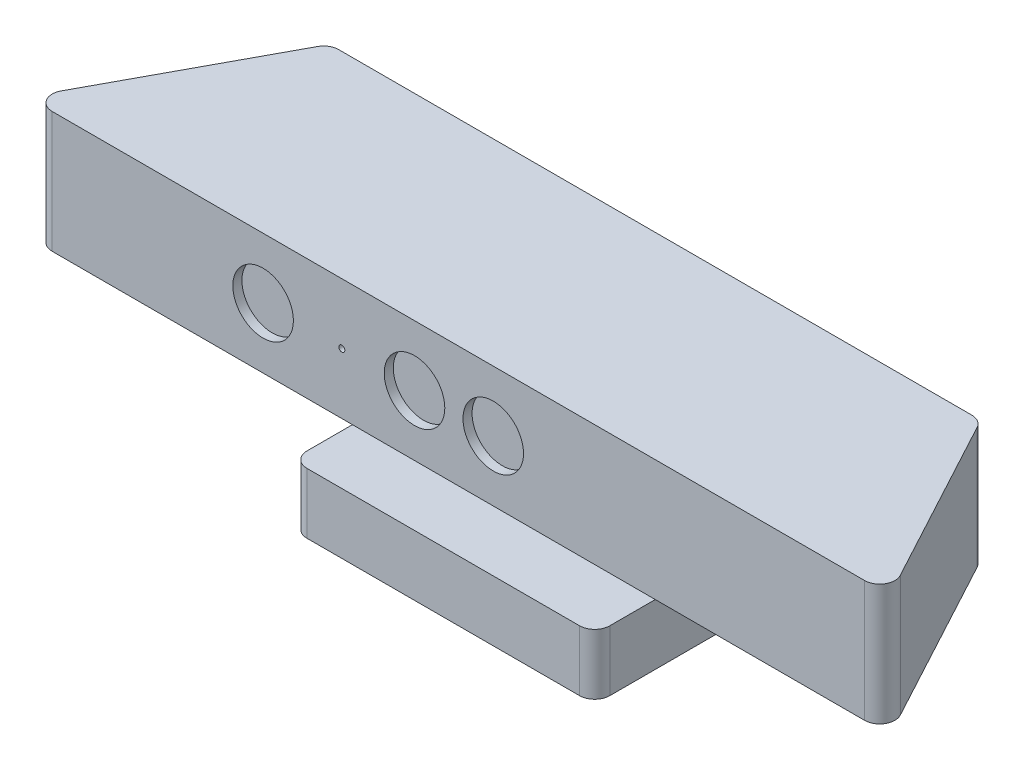
ISO-10303-21;
HEADER;
FILE_DESCRIPTION(('STEP AP214'),'2;1');
FILE_NAME('part.step','',(''),(''),'','','');
FILE_SCHEMA(('AUTOMOTIVE_DESIGN { 1 0 10303 214 1 1 1 1 }'));
ENDSEC;
DATA;
#1=APPLICATION_CONTEXT('core data for automotive mechanical design processes');
#2=APPLICATION_PROTOCOL_DEFINITION('international standard','automotive_design',2000,#1);
#3=PRODUCT_CONTEXT('',#1,'mechanical');
#4=PRODUCT('Part','Part','',(#3));
#5=PRODUCT_RELATED_PRODUCT_CATEGORY('part','',(#4));
#6=PRODUCT_DEFINITION_FORMATION('','',#4);
#7=PRODUCT_DEFINITION_CONTEXT('part definition',#1,'design');
#8=PRODUCT_DEFINITION('design','',#6,#7);
#9=PRODUCT_DEFINITION_SHAPE('','',#8);
#10=(LENGTH_UNIT() NAMED_UNIT(*) SI_UNIT(.MILLI.,.METRE.));
#11=(NAMED_UNIT(*) PLANE_ANGLE_UNIT() SI_UNIT($,.RADIAN.));
#12=(NAMED_UNIT(*) SI_UNIT($,.STERADIAN.) SOLID_ANGLE_UNIT());
#13=UNCERTAINTY_MEASURE_WITH_UNIT(LENGTH_MEASURE(1.E-05),#10,'distance_accuracy_value','');
#14=(GEOMETRIC_REPRESENTATION_CONTEXT(3) GLOBAL_UNCERTAINTY_ASSIGNED_CONTEXT((#13)) GLOBAL_UNIT_ASSIGNED_CONTEXT((#10,
#11,#12)) REPRESENTATION_CONTEXT('',''));
#15=CARTESIAN_POINT('',(0.,0.,0.));
#16=DIRECTION('',(0.,0.,1.));
#17=DIRECTION('',(1.,0.,0.));
#18=AXIS2_PLACEMENT_3D('',#15,#16,#17);
#19=CARTESIAN_POINT('',(-142.5,40.,80.7413552305434));
#20=DIRECTION('',(0.,0.,-1.));
#21=DIRECTION('',(-1.,0.,0.));
#22=AXIS2_PLACEMENT_3D('',#19,#20,#21);
#23=PLANE('',#22);
#24=CARTESIAN_POINT('',(11.5,20.,80.7413552305434));
#25=DIRECTION('',(0.,0.,1.));
#26=DIRECTION('',(1.,0.,0.));
#27=AXIS2_PLACEMENT_3D('',#24,#25,#26);
#28=CIRCLE('',#27,10.);
#29=CARTESIAN_POINT('',(21.5,20.,80.7413552305434));
#30=VERTEX_POINT('',#29);
#31=EDGE_CURVE('E270',#30,#30,#28,.T.);
#32=ORIENTED_EDGE('',*,*,#31,.F.);
#33=EDGE_LOOP('',(#32));
#34=FACE_BOUND('',#33,.T.);
#35=CARTESIAN_POINT('',(-14.5,20.,80.7413552305434));
#36=DIRECTION('',(0.,0.,1.));
#37=DIRECTION('',(1.,0.,0.));
#38=AXIS2_PLACEMENT_3D('',#35,#36,#37);
#39=CIRCLE('',#38,10.);
#40=CARTESIAN_POINT('',(-4.49999999999996,20.,80.7413552305434));
#41=VERTEX_POINT('',#40);
#42=EDGE_CURVE('E275',#41,#41,#39,.T.);
#43=ORIENTED_EDGE('',*,*,#42,.F.);
#44=EDGE_LOOP('',(#43));
#45=FACE_BOUND('',#44,.T.);
#46=CARTESIAN_POINT('',(-38.5,20.,80.7413552305434));
#47=DIRECTION('',(0.,0.,1.));
#48=DIRECTION('',(1.,0.,0.));
#49=AXIS2_PLACEMENT_3D('',#46,#47,#48);
#50=CIRCLE('',#49,0.999999999999998);
#51=CARTESIAN_POINT('',(-37.5,20.,80.7413552305434));
#52=VERTEX_POINT('',#51);
#53=EDGE_CURVE('E281',#52,#52,#50,.T.);
#54=ORIENTED_EDGE('',*,*,#53,.F.);
#55=EDGE_LOOP('',(#54));
#56=FACE_BOUND('',#55,.T.);
#57=CARTESIAN_POINT('',(-64.5,20.,80.7413552305434));
#58=DIRECTION('',(0.,0.,1.));
#59=DIRECTION('',(1.,0.,0.));
#60=AXIS2_PLACEMENT_3D('',#57,#58,#59);
#61=CIRCLE('',#60,9.99999999999999);
#62=CARTESIAN_POINT('',(-54.5,20.,80.7413552305434));
#63=VERTEX_POINT('',#62);
#64=EDGE_CURVE('E287',#63,#63,#61,.T.);
#65=ORIENTED_EDGE('',*,*,#64,.F.);
#66=EDGE_LOOP('',(#65));
#67=FACE_BOUND('',#66,.T.);
#68=DIRECTION('',(1.,0.,0.));
#69=VECTOR('',#68,1.);
#70=CARTESIAN_POINT('',(-142.5,0.,80.7413552305434));
#71=LINE('',#70,#69);
#72=CARTESIAN_POINT('',(-134.128914207603,0.,80.7413552305434));
#73=VERTEX_POINT('',#72);
#74=CARTESIAN_POINT('',(134.128914207603,0.,80.7413552305434));
#75=VERTEX_POINT('',#74);
#76=EDGE_CURVE('E174',#73,#75,#71,.T.);
#77=ORIENTED_EDGE('',*,*,#76,.T.);
#78=DIRECTION('',(0.,-1.,0.));
#79=VECTOR('',#78,1.);
#80=CARTESIAN_POINT('',(134.128914207603,40.,80.7413552305434));
#81=LINE('',#80,#79);
#82=CARTESIAN_POINT('',(134.128914207603,40.,80.7413552305434));
#83=VERTEX_POINT('',#82);
#84=EDGE_CURVE('E152',#75,#83,#81,.F.);
#85=ORIENTED_EDGE('',*,*,#84,.T.);
#86=DIRECTION('',(1.,0.,0.));
#87=VECTOR('',#86,1.);
#88=CARTESIAN_POINT('',(-142.5,40.,80.7413552305434));
#89=LINE('',#88,#87);
#90=CARTESIAN_POINT('',(-134.128914207603,40.,80.7413552305434));
#91=VERTEX_POINT('',#90);
#92=EDGE_CURVE('E184',#91,#83,#89,.T.);
#93=ORIENTED_EDGE('',*,*,#92,.F.);
#94=DIRECTION('',(0.,-1.,0.));
#95=VECTOR('',#94,1.);
#96=CARTESIAN_POINT('',(-134.128914207603,0.,80.7413552305434));
#97=LINE('',#96,#95);
#98=EDGE_CURVE('E157',#91,#73,#97,.T.);
#99=ORIENTED_EDGE('',*,*,#98,.T.);
#100=EDGE_LOOP('',(#77,#85,#93,#99));
#101=FACE_BOUND('',#100,.T.);
#102=ADVANCED_FACE('F34',(#34,#45,#56,#67,#101),#23,.F.);
#103=CARTESIAN_POINT('',(142.5,40.,80.7413552305434));
#104=DIRECTION('',(-0.880471099922175,0.,0.474099823035017));
#105=DIRECTION('',(0.474099823035017,0.,0.880471099922176));
#106=AXIS2_PLACEMENT_3D('',#103,#104,#105);
#107=PLANE('',#106);
#108=DIRECTION('',(-0.474099823035017,0.,-0.880471099922175));
#109=VECTOR('',#108,1.);
#110=CARTESIAN_POINT('',(142.5,40.,80.7413552305434));
#111=LINE('',#110,#109);
#112=CARTESIAN_POINT('',(138.531269707213,40.,73.3708561153683));
#113=VERTEX_POINT('',#112);
#114=CARTESIAN_POINT('',(108.915885091829,40.,18.3708561153683));
#115=VERTEX_POINT('',#114);
#116=EDGE_CURVE('E167',#113,#115,#111,.T.);
#117=ORIENTED_EDGE('',*,*,#116,.F.);
#118=DIRECTION('',(0.,-1.,0.));
#119=VECTOR('',#118,1.);
#120=CARTESIAN_POINT('',(138.531269707213,40.,73.3708561153683));
#121=LINE('',#120,#119);
#122=CARTESIAN_POINT('',(138.531269707213,0.,73.3708561153683));
#123=VERTEX_POINT('',#122);
#124=EDGE_CURVE('E151',#113,#123,#121,.T.);
#125=ORIENTED_EDGE('',*,*,#124,.T.);
#126=DIRECTION('',(-0.474099823035017,0.,-0.880471099922175));
#127=VECTOR('',#126,1.);
#128=CARTESIAN_POINT('',(142.5,0.,80.7413552305434));
#129=LINE('',#128,#127);
#130=CARTESIAN_POINT('',(108.915885091829,0.,18.3708561153683));
#131=VERTEX_POINT('',#130);
#132=EDGE_CURVE('E164',#123,#131,#129,.T.);
#133=ORIENTED_EDGE('',*,*,#132,.T.);
#134=DIRECTION('',(0.,-1.,0.));
#135=VECTOR('',#134,1.);
#136=CARTESIAN_POINT('',(108.915885091829,40.,18.3708561153683));
#137=LINE('',#136,#135);
#138=EDGE_CURVE('E169',#131,#115,#137,.F.);
#139=ORIENTED_EDGE('',*,*,#138,.T.);
#140=EDGE_LOOP('',(#117,#125,#133,#139));
#141=FACE_BOUND('',#140,.T.);
#142=ADVANCED_FACE('F163',(#141),#107,.F.);
#143=CARTESIAN_POINT('',(-107.5,40.,15.7413552305434));
#144=DIRECTION('',(0.,0.,-1.));
#145=DIRECTION('',(-1.,0.,0.));
#146=AXIS2_PLACEMENT_3D('',#143,#144,#145);
#147=PLANE('',#146);
#148=DIRECTION('',(1.,0.,0.));
#149=VECTOR('',#148,1.);
#150=CARTESIAN_POINT('',(-107.5,40.,15.7413552305434));
#151=LINE('',#150,#149);
#152=CARTESIAN_POINT('',(-104.513529592218,40.,15.7413552305434));
#153=VERTEX_POINT('',#152);
#154=CARTESIAN_POINT('',(104.513529592218,40.,15.7413552305434));
#155=VERTEX_POINT('',#154);
#156=EDGE_CURVE('E297',#153,#155,#151,.T.);
#157=ORIENTED_EDGE('',*,*,#156,.T.);
#158=DIRECTION('',(0.,-1.,0.));
#159=VECTOR('',#158,1.);
#160=CARTESIAN_POINT('',(104.513529592218,0.,15.7413552305434));
#161=LINE('',#160,#159);
#162=CARTESIAN_POINT('',(104.513529592218,0.,15.7413552305434));
#163=VERTEX_POINT('',#162);
#164=EDGE_CURVE('E207',#155,#163,#161,.T.);
#165=ORIENTED_EDGE('',*,*,#164,.T.);
#166=DIRECTION('',(1.,0.,0.));
#167=VECTOR('',#166,1.);
#168=CARTESIAN_POINT('',(-107.5,0.,15.7413552305434));
#169=LINE('',#168,#167);
#170=CARTESIAN_POINT('',(-104.513529592218,0.,15.7413552305434));
#171=VERTEX_POINT('',#170);
#172=EDGE_CURVE('E173',#171,#163,#169,.T.);
#173=ORIENTED_EDGE('',*,*,#172,.F.);
#174=DIRECTION('',(0.,-1.,0.));
#175=VECTOR('',#174,1.);
#176=CARTESIAN_POINT('',(-104.513529592218,40.,15.7413552305434));
#177=LINE('',#176,#175);
#178=EDGE_CURVE('E205',#171,#153,#177,.F.);
#179=ORIENTED_EDGE('',*,*,#178,.T.);
#180=EDGE_LOOP('',(#157,#165,#173,#179));
#181=FACE_BOUND('',#180,.T.);
#182=ADVANCED_FACE('F314',(#181),#147,.T.);
#183=CARTESIAN_POINT('',(-142.5,40.,80.7413552305434));
#184=DIRECTION('',(-0.880471099922175,0.,-0.474099823035017));
#185=DIRECTION('',(-0.474099823035017,0.,0.880471099922175));
#186=AXIS2_PLACEMENT_3D('',#183,#184,#185);
#187=PLANE('',#186);
#188=DIRECTION('',(0.474099823035017,0.,-0.880471099922175));
#189=VECTOR('',#188,1.);
#190=CARTESIAN_POINT('',(-142.5,40.,80.7413552305434));
#191=LINE('',#190,#189);
#192=CARTESIAN_POINT('',(-138.531269707213,40.,73.3708561153683));
#193=VERTEX_POINT('',#192);
#194=CARTESIAN_POINT('',(-108.915885091829,40.,18.3708561153683));
#195=VERTEX_POINT('',#194);
#196=EDGE_CURVE('E188',#193,#195,#191,.T.);
#197=ORIENTED_EDGE('',*,*,#196,.T.);
#198=DIRECTION('',(0.,-1.,0.));
#199=VECTOR('',#198,1.);
#200=CARTESIAN_POINT('',(-108.915885091829,40.,18.3708561153683));
#201=LINE('',#200,#199);
#202=CARTESIAN_POINT('',(-108.915885091829,0.,18.3708561153683));
#203=VERTEX_POINT('',#202);
#204=EDGE_CURVE('E212',#195,#203,#201,.T.);
#205=ORIENTED_EDGE('',*,*,#204,.T.);
#206=DIRECTION('',(0.474099823035017,0.,-0.880471099922175));
#207=VECTOR('',#206,1.);
#208=CARTESIAN_POINT('',(-142.5,0.,80.7413552305434));
#209=LINE('',#208,#207);
#210=CARTESIAN_POINT('',(-138.531269707213,0.,73.3708561153683));
#211=VERTEX_POINT('',#210);
#212=EDGE_CURVE('E176',#211,#203,#209,.T.);
#213=ORIENTED_EDGE('',*,*,#212,.F.);
#214=DIRECTION('',(0.,-1.,0.));
#215=VECTOR('',#214,1.);
#216=CARTESIAN_POINT('',(-138.531269707213,40.,73.3708561153683));
#217=LINE('',#216,#215);
#218=EDGE_CURVE('E210',#211,#193,#217,.F.);
#219=ORIENTED_EDGE('',*,*,#218,.T.);
#220=EDGE_LOOP('',(#197,#205,#213,#219));
#221=FACE_BOUND('',#220,.T.);
#222=ADVANCED_FACE('F303',(#221),#187,.T.);
#223=CARTESIAN_POINT('',(0.,40.,0.));
#224=DIRECTION('',(0.,1.,0.));
#225=DIRECTION('',(0.,0.,1.));
#226=AXIS2_PLACEMENT_3D('',#223,#224,#225);
#227=PLANE('',#226);
#228=ORIENTED_EDGE('',*,*,#92,.T.);
#229=CARTESIAN_POINT('',(134.128914207603,40.,75.7413552305434));
#230=DIRECTION('',(0.,1.,0.));
#231=DIRECTION('',(0.,0.,1.));
#232=AXIS2_PLACEMENT_3D('',#229,#230,#231);
#233=CIRCLE('',#232,5.);
#234=EDGE_CURVE('E203',#83,#113,#233,.T.);
#235=ORIENTED_EDGE('',*,*,#234,.T.);
#236=ORIENTED_EDGE('',*,*,#116,.T.);
#237=CARTESIAN_POINT('',(104.513529592218,40.,20.7413552305434));
#238=DIRECTION('',(0.,1.,0.));
#239=DIRECTION('',(0.,0.,1.));
#240=AXIS2_PLACEMENT_3D('',#237,#238,#239);
#241=CIRCLE('',#240,5.);
#242=EDGE_CURVE('E201',#115,#155,#241,.T.);
#243=ORIENTED_EDGE('',*,*,#242,.T.);
#244=ORIENTED_EDGE('',*,*,#156,.F.);
#245=CARTESIAN_POINT('',(-104.513529592218,40.,20.7413552305434));
#246=DIRECTION('',(0.,1.,0.));
#247=DIRECTION('',(0.,0.,1.));
#248=AXIS2_PLACEMENT_3D('',#245,#246,#247);
#249=CIRCLE('',#248,5.);
#250=EDGE_CURVE('E199',#153,#195,#249,.T.);
#251=ORIENTED_EDGE('',*,*,#250,.T.);
#252=ORIENTED_EDGE('',*,*,#196,.F.);
#253=CARTESIAN_POINT('',(-134.128914207603,40.,75.7413552305434));
#254=DIRECTION('',(0.,1.,0.));
#255=DIRECTION('',(0.,0.,1.));
#256=AXIS2_PLACEMENT_3D('',#253,#254,#255);
#257=CIRCLE('',#256,5.);
#258=EDGE_CURVE('E197',#193,#91,#257,.T.);
#259=ORIENTED_EDGE('',*,*,#258,.T.);
#260=EDGE_LOOP('',(#228,#235,#236,#243,#244,#251,#252,#259));
#261=FACE_BOUND('',#260,.T.);
#262=ADVANCED_FACE('F320',(#261),#227,.T.);
#263=CARTESIAN_POINT('',(0.,0.,0.));
#264=DIRECTION('',(0.,1.,0.));
#265=DIRECTION('',(0.,0.,1.));
#266=AXIS2_PLACEMENT_3D('',#263,#264,#265);
#267=PLANE('',#266);
#268=CARTESIAN_POINT('',(0.,0.,48.2413552305434));
#269=DIRECTION('',(0.,1.,0.));
#270=DIRECTION('',(0.,0.,1.));
#271=AXIS2_PLACEMENT_3D('',#268,#269,#270);
#272=CIRCLE('',#271,10.);
#273=CARTESIAN_POINT('',(0.,0.,58.2413552305434));
#274=VERTEX_POINT('',#273);
#275=EDGE_CURVE('E185',#274,#274,#272,.F.);
#276=ORIENTED_EDGE('',*,*,#275,.F.);
#277=EDGE_LOOP('',(#276));
#278=FACE_BOUND('',#277,.T.);
#279=ORIENTED_EDGE('',*,*,#132,.F.);
#280=CARTESIAN_POINT('',(134.128914207603,0.,75.7413552305434));
#281=DIRECTION('',(0.,1.,0.));
#282=DIRECTION('',(0.,0.,1.));
#283=AXIS2_PLACEMENT_3D('',#280,#281,#282);
#284=CIRCLE('',#283,5.);
#285=EDGE_CURVE('E147',#123,#75,#284,.F.);
#286=ORIENTED_EDGE('',*,*,#285,.T.);
#287=ORIENTED_EDGE('',*,*,#76,.F.);
#288=CARTESIAN_POINT('',(-134.128914207603,0.,75.7413552305434));
#289=DIRECTION('',(0.,1.,0.));
#290=DIRECTION('',(0.,0.,1.));
#291=AXIS2_PLACEMENT_3D('',#288,#289,#290);
#292=CIRCLE('',#291,5.);
#293=EDGE_CURVE('E168',#73,#211,#292,.F.);
#294=ORIENTED_EDGE('',*,*,#293,.T.);
#295=ORIENTED_EDGE('',*,*,#212,.T.);
#296=CARTESIAN_POINT('',(-104.513529592218,0.,20.7413552305434));
#297=DIRECTION('',(0.,1.,0.));
#298=DIRECTION('',(0.,0.,1.));
#299=AXIS2_PLACEMENT_3D('',#296,#297,#298);
#300=CIRCLE('',#299,5.);
#301=EDGE_CURVE('E191',#203,#171,#300,.F.);
#302=ORIENTED_EDGE('',*,*,#301,.T.);
#303=ORIENTED_EDGE('',*,*,#172,.T.);
#304=CARTESIAN_POINT('',(104.513529592218,0.,20.7413552305434));
#305=DIRECTION('',(0.,1.,0.));
#306=DIRECTION('',(0.,0.,1.));
#307=AXIS2_PLACEMENT_3D('',#304,#305,#306);
#308=CIRCLE('',#307,5.);
#309=EDGE_CURVE('E158',#163,#131,#308,.F.);
#310=ORIENTED_EDGE('',*,*,#309,.T.);
#311=EDGE_LOOP('',(#279,#286,#287,#294,#295,#302,#303,#310));
#312=FACE_BOUND('',#311,.T.);
#313=ADVANCED_FACE('F171',(#278,#312),#267,.F.);
#314=CARTESIAN_POINT('',(-64.5,20.,77.7413552305434));
#315=DIRECTION('',(0.,0.,1.));
#316=DIRECTION('',(1.,0.,0.));
#317=AXIS2_PLACEMENT_3D('',#314,#315,#316);
#318=CYLINDRICAL_SURFACE('',#317,9.99999999999999);
#319=CARTESIAN_POINT('',(-64.5,20.,77.7413552305434));
#320=DIRECTION('',(0.,0.,1.));
#321=DIRECTION('',(1.,0.,0.));
#322=AXIS2_PLACEMENT_3D('',#319,#320,#321);
#323=CIRCLE('',#322,9.99999999999999);
#324=CARTESIAN_POINT('',(-54.5,20.,77.7413552305434));
#325=VERTEX_POINT('',#324);
#326=EDGE_CURVE('E178',#325,#325,#323,.T.);
#327=ORIENTED_EDGE('',*,*,#326,.F.);
#328=EDGE_LOOP('',(#327));
#329=FACE_BOUND('',#328,.T.);
#330=ORIENTED_EDGE('',*,*,#64,.T.);
#331=EDGE_LOOP('',(#330));
#332=FACE_BOUND('',#331,.T.);
#333=ADVANCED_FACE('F488',(#329,#332),#318,.F.);
#334=CARTESIAN_POINT('',(-64.5,20.,77.7413552305434));
#335=DIRECTION('',(0.,0.,1.));
#336=DIRECTION('',(1.,0.,0.));
#337=AXIS2_PLACEMENT_3D('',#334,#335,#336);
#338=PLANE('',#337);
#339=ORIENTED_EDGE('',*,*,#326,.T.);
#340=EDGE_LOOP('',(#339));
#341=FACE_BOUND('',#340,.T.);
#342=ADVANCED_FACE('F595',(#341),#338,.T.);
#343=CARTESIAN_POINT('',(-38.5,20.,77.7413552305434));
#344=DIRECTION('',(0.,0.,1.));
#345=DIRECTION('',(1.,0.,0.));
#346=AXIS2_PLACEMENT_3D('',#343,#344,#345);
#347=CYLINDRICAL_SURFACE('',#346,0.999999999999998);
#348=CARTESIAN_POINT('',(-38.5,20.,77.7413552305434));
#349=DIRECTION('',(0.,0.,1.));
#350=DIRECTION('',(1.,0.,0.));
#351=AXIS2_PLACEMENT_3D('',#348,#349,#350);
#352=CIRCLE('',#351,0.999999999999998);
#353=CARTESIAN_POINT('',(-37.5,20.,77.7413552305434));
#354=VERTEX_POINT('',#353);
#355=EDGE_CURVE('E284',#354,#354,#352,.T.);
#356=ORIENTED_EDGE('',*,*,#355,.F.);
#357=EDGE_LOOP('',(#356));
#358=FACE_BOUND('',#357,.T.);
#359=ORIENTED_EDGE('',*,*,#53,.T.);
#360=EDGE_LOOP('',(#359));
#361=FACE_BOUND('',#360,.T.);
#362=ADVANCED_FACE('F585',(#358,#361),#347,.F.);
#363=CARTESIAN_POINT('',(-38.5,20.,77.7413552305434));
#364=DIRECTION('',(0.,0.,1.));
#365=DIRECTION('',(1.,0.,0.));
#366=AXIS2_PLACEMENT_3D('',#363,#364,#365);
#367=PLANE('',#366);
#368=ORIENTED_EDGE('',*,*,#355,.T.);
#369=EDGE_LOOP('',(#368));
#370=FACE_BOUND('',#369,.T.);
#371=ADVANCED_FACE('F575',(#370),#367,.T.);
#372=CARTESIAN_POINT('',(-14.5,20.,77.7413552305434));
#373=DIRECTION('',(0.,0.,1.));
#374=DIRECTION('',(1.,0.,0.));
#375=AXIS2_PLACEMENT_3D('',#372,#373,#374);
#376=CYLINDRICAL_SURFACE('',#375,10.);
#377=CARTESIAN_POINT('',(-14.5,20.,77.7413552305434));
#378=DIRECTION('',(0.,0.,1.));
#379=DIRECTION('',(1.,0.,0.));
#380=AXIS2_PLACEMENT_3D('',#377,#378,#379);
#381=CIRCLE('',#380,10.);
#382=CARTESIAN_POINT('',(-4.49999999999996,20.,77.7413552305434));
#383=VERTEX_POINT('',#382);
#384=EDGE_CURVE('E278',#383,#383,#381,.T.);
#385=ORIENTED_EDGE('',*,*,#384,.F.);
#386=EDGE_LOOP('',(#385));
#387=FACE_BOUND('',#386,.T.);
#388=ORIENTED_EDGE('',*,*,#42,.T.);
#389=EDGE_LOOP('',(#388));
#390=FACE_BOUND('',#389,.T.);
#391=ADVANCED_FACE('F564',(#387,#390),#376,.F.);
#392=CARTESIAN_POINT('',(-14.5,20.,77.7413552305434));
#393=DIRECTION('',(0.,0.,1.));
#394=DIRECTION('',(1.,0.,0.));
#395=AXIS2_PLACEMENT_3D('',#392,#393,#394);
#396=PLANE('',#395);
#397=ORIENTED_EDGE('',*,*,#384,.T.);
#398=EDGE_LOOP('',(#397));
#399=FACE_BOUND('',#398,.T.);
#400=ADVANCED_FACE('F554',(#399),#396,.T.);
#401=CARTESIAN_POINT('',(11.5,20.,77.7413552305434));
#402=DIRECTION('',(0.,0.,1.));
#403=DIRECTION('',(1.,0.,0.));
#404=AXIS2_PLACEMENT_3D('',#401,#402,#403);
#405=CYLINDRICAL_SURFACE('',#404,10.);
#406=CARTESIAN_POINT('',(11.5,20.,77.7413552305434));
#407=DIRECTION('',(0.,0.,1.));
#408=DIRECTION('',(1.,0.,0.));
#409=AXIS2_PLACEMENT_3D('',#406,#407,#408);
#410=CIRCLE('',#409,10.);
#411=CARTESIAN_POINT('',(21.5,20.,77.7413552305434));
#412=VERTEX_POINT('',#411);
#413=EDGE_CURVE('E272',#412,#412,#410,.T.);
#414=ORIENTED_EDGE('',*,*,#413,.F.);
#415=EDGE_LOOP('',(#414));
#416=FACE_BOUND('',#415,.T.);
#417=ORIENTED_EDGE('',*,*,#31,.T.);
#418=EDGE_LOOP('',(#417));
#419=FACE_BOUND('',#418,.T.);
#420=ADVANCED_FACE('F542',(#416,#419),#405,.F.);
#421=CARTESIAN_POINT('',(11.5,20.,77.7413552305434));
#422=DIRECTION('',(0.,0.,1.));
#423=DIRECTION('',(1.,0.,0.));
#424=AXIS2_PLACEMENT_3D('',#421,#422,#423);
#425=PLANE('',#424);
#426=ORIENTED_EDGE('',*,*,#413,.T.);
#427=EDGE_LOOP('',(#426));
#428=FACE_BOUND('',#427,.T.);
#429=ADVANCED_FACE('F531',(#428),#425,.T.);
#430=CARTESIAN_POINT('',(0.,-15.,48.2413552305434));
#431=DIRECTION('',(0.,1.,0.));
#432=DIRECTION('',(0.,0.,1.));
#433=AXIS2_PLACEMENT_3D('',#430,#431,#432);
#434=CYLINDRICAL_SURFACE('',#433,10.);
#435=CARTESIAN_POINT('',(0.,-15.,48.2413552305434));
#436=DIRECTION('',(0.,-1.,0.));
#437=DIRECTION('',(0.,0.,-1.));
#438=AXIS2_PLACEMENT_3D('',#435,#436,#437);
#439=CIRCLE('',#438,10.);
#440=CARTESIAN_POINT('',(0.,-15.,38.2413552305434));
#441=VERTEX_POINT('',#440);
#442=EDGE_CURVE('E267',#441,#441,#439,.T.);
#443=ORIENTED_EDGE('',*,*,#442,.F.);
#444=EDGE_LOOP('',(#443));
#445=FACE_BOUND('',#444,.T.);
#446=ORIENTED_EDGE('',*,*,#275,.T.);
#447=EDGE_LOOP('',(#446));
#448=FACE_BOUND('',#447,.T.);
#449=ADVANCED_FACE('F376',(#445,#448),#434,.T.);
#450=CARTESIAN_POINT('',(50.,-35.,85.7413552305434));
#451=DIRECTION('',(-1.,0.,0.));
#452=DIRECTION('',(0.,0.,1.));
#453=AXIS2_PLACEMENT_3D('',#450,#451,#452);
#454=PLANE('',#453);
#455=DIRECTION('',(0.,0.,1.));
#456=VECTOR('',#455,1.);
#457=CARTESIAN_POINT('',(50.,-35.,85.7413552305434));
#458=LINE('',#457,#456);
#459=CARTESIAN_POINT('',(50.,-35.,15.7413552305434));
#460=VERTEX_POINT('',#459);
#461=CARTESIAN_POINT('',(50.,-35.,80.7413552305434));
#462=VERTEX_POINT('',#461);
#463=EDGE_CURVE('E261',#460,#462,#458,.T.);
#464=ORIENTED_EDGE('',*,*,#463,.F.);
#465=DIRECTION('',(0.,1.,0.));
#466=VECTOR('',#465,1.);
#467=CARTESIAN_POINT('',(50.,-35.,15.7413552305434));
#468=LINE('',#467,#466);
#469=CARTESIAN_POINT('',(50.,-15.,15.7413552305434));
#470=VERTEX_POINT('',#469);
#471=EDGE_CURVE('E217',#460,#470,#468,.T.);
#472=ORIENTED_EDGE('',*,*,#471,.T.);
#473=DIRECTION('',(0.,0.,1.));
#474=VECTOR('',#473,1.);
#475=CARTESIAN_POINT('',(50.,-15.,85.7413552305434));
#476=LINE('',#475,#474);
#477=CARTESIAN_POINT('',(50.,-15.,80.7413552305434));
#478=VERTEX_POINT('',#477);
#479=EDGE_CURVE('E263',#470,#478,#476,.T.);
#480=ORIENTED_EDGE('',*,*,#479,.T.);
#481=DIRECTION('',(0.,1.,0.));
#482=VECTOR('',#481,1.);
#483=CARTESIAN_POINT('',(50.,-35.,80.7413552305434));
#484=LINE('',#483,#482);
#485=EDGE_CURVE('E215',#478,#462,#484,.F.);
#486=ORIENTED_EDGE('',*,*,#485,.T.);
#487=EDGE_LOOP('',(#464,#472,#480,#486));
#488=FACE_BOUND('',#487,.T.);
#489=ADVANCED_FACE('F370',(#488),#454,.F.);
#490=CARTESIAN_POINT('',(-50.,-35.,85.7413552305434));
#491=DIRECTION('',(0.,0.,-1.));
#492=DIRECTION('',(-1.,0.,0.));
#493=AXIS2_PLACEMENT_3D('',#490,#491,#492);
#494=PLANE('',#493);
#495=DIRECTION('',(-1.,0.,0.));
#496=VECTOR('',#495,1.);
#497=CARTESIAN_POINT('',(-50.,-35.,85.7413552305434));
#498=LINE('',#497,#496);
#499=CARTESIAN_POINT('',(45.,-35.,85.7413552305434));
#500=VERTEX_POINT('',#499);
#501=CARTESIAN_POINT('',(-45.,-35.,85.7413552305434));
#502=VERTEX_POINT('',#501);
#503=EDGE_CURVE('E460',#500,#502,#498,.T.);
#504=ORIENTED_EDGE('',*,*,#503,.F.);
#505=DIRECTION('',(0.,1.,0.));
#506=VECTOR('',#505,1.);
#507=CARTESIAN_POINT('',(45.,-35.,85.7413552305434));
#508=LINE('',#507,#506);
#509=CARTESIAN_POINT('',(45.,-15.,85.7413552305434));
#510=VERTEX_POINT('',#509);
#511=EDGE_CURVE('E242',#500,#510,#508,.T.);
#512=ORIENTED_EDGE('',*,*,#511,.T.);
#513=DIRECTION('',(-1.,0.,0.));
#514=VECTOR('',#513,1.);
#515=CARTESIAN_POINT('',(-50.,-15.,85.7413552305434));
#516=LINE('',#515,#514);
#517=CARTESIAN_POINT('',(-45.,-15.,85.7413552305434));
#518=VERTEX_POINT('',#517);
#519=EDGE_CURVE('E258',#510,#518,#516,.T.);
#520=ORIENTED_EDGE('',*,*,#519,.T.);
#521=DIRECTION('',(0.,1.,0.));
#522=VECTOR('',#521,1.);
#523=CARTESIAN_POINT('',(-45.,-35.,85.7413552305434));
#524=LINE('',#523,#522);
#525=EDGE_CURVE('E240',#518,#502,#524,.F.);
#526=ORIENTED_EDGE('',*,*,#525,.T.);
#527=EDGE_LOOP('',(#504,#512,#520,#526));
#528=FACE_BOUND('',#527,.T.);
#529=ADVANCED_FACE('F375',(#528),#494,.F.);
#530=CARTESIAN_POINT('',(-50.,-35.,85.7413552305434));
#531=DIRECTION('',(1.,0.,0.));
#532=DIRECTION('',(0.,0.,-1.));
#533=AXIS2_PLACEMENT_3D('',#530,#531,#532);
#534=PLANE('',#533);
#535=DIRECTION('',(0.,0.,-1.));
#536=VECTOR('',#535,1.);
#537=CARTESIAN_POINT('',(-50.,-15.,85.7413552305434));
#538=LINE('',#537,#536);
#539=CARTESIAN_POINT('',(-50.,-15.,80.7413552305434));
#540=VERTEX_POINT('',#539);
#541=CARTESIAN_POINT('',(-50.,-15.,15.7413552305434));
#542=VERTEX_POINT('',#541);
#543=EDGE_CURVE('E248',#540,#542,#538,.T.);
#544=ORIENTED_EDGE('',*,*,#543,.T.);
#545=DIRECTION('',(0.,1.,0.));
#546=VECTOR('',#545,1.);
#547=CARTESIAN_POINT('',(-50.,-35.,15.7413552305434));
#548=LINE('',#547,#546);
#549=CARTESIAN_POINT('',(-50.,-35.,15.7413552305434));
#550=VERTEX_POINT('',#549);
#551=EDGE_CURVE('E11',#542,#550,#548,.F.);
#552=ORIENTED_EDGE('',*,*,#551,.T.);
#553=DIRECTION('',(0.,0.,-1.));
#554=VECTOR('',#553,1.);
#555=CARTESIAN_POINT('',(-50.,-35.,85.7413552305434));
#556=LINE('',#555,#554);
#557=CARTESIAN_POINT('',(-50.,-35.,80.7413552305434));
#558=VERTEX_POINT('',#557);
#559=EDGE_CURVE('E249',#558,#550,#556,.T.);
#560=ORIENTED_EDGE('',*,*,#559,.F.);
#561=DIRECTION('',(0.,1.,0.));
#562=VECTOR('',#561,1.);
#563=CARTESIAN_POINT('',(-50.,-35.,80.7413552305434));
#564=LINE('',#563,#562);
#565=EDGE_CURVE('E42',#558,#540,#564,.T.);
#566=ORIENTED_EDGE('',*,*,#565,.T.);
#567=EDGE_LOOP('',(#544,#552,#560,#566));
#568=FACE_BOUND('',#567,.T.);
#569=ADVANCED_FACE('F247',(#568),#534,.F.);
#570=CARTESIAN_POINT('',(-50.,-35.,10.7413552305434));
#571=DIRECTION('',(0.,0.,1.));
#572=DIRECTION('',(1.,0.,0.));
#573=AXIS2_PLACEMENT_3D('',#570,#571,#572);
#574=PLANE('',#573);
#575=DIRECTION('',(1.,0.,0.));
#576=VECTOR('',#575,1.);
#577=CARTESIAN_POINT('',(-50.,-15.,10.7413552305434));
#578=LINE('',#577,#576);
#579=CARTESIAN_POINT('',(-45.,-15.,10.7413552305434));
#580=VERTEX_POINT('',#579);
#581=CARTESIAN_POINT('',(45.,-15.,10.7413552305434));
#582=VERTEX_POINT('',#581);
#583=EDGE_CURVE('E257',#580,#582,#578,.T.);
#584=ORIENTED_EDGE('',*,*,#583,.T.);
#585=DIRECTION('',(0.,1.,0.));
#586=VECTOR('',#585,1.);
#587=CARTESIAN_POINT('',(45.,-35.,10.7413552305434));
#588=LINE('',#587,#586);
#589=CARTESIAN_POINT('',(45.,-35.,10.7413552305434));
#590=VERTEX_POINT('',#589);
#591=EDGE_CURVE('E231',#582,#590,#588,.F.);
#592=ORIENTED_EDGE('',*,*,#591,.T.);
#593=DIRECTION('',(1.,0.,0.));
#594=VECTOR('',#593,1.);
#595=CARTESIAN_POINT('',(-50.,-35.,10.7413552305434));
#596=LINE('',#595,#594);
#597=CARTESIAN_POINT('',(-45.,-35.,10.7413552305434));
#598=VERTEX_POINT('',#597);
#599=EDGE_CURVE('E271',#598,#590,#596,.T.);
#600=ORIENTED_EDGE('',*,*,#599,.F.);
#601=DIRECTION('',(0.,1.,0.));
#602=VECTOR('',#601,1.);
#603=CARTESIAN_POINT('',(-45.,-35.,10.7413552305434));
#604=LINE('',#603,#602);
#605=EDGE_CURVE('E228',#598,#580,#604,.T.);
#606=ORIENTED_EDGE('',*,*,#605,.T.);
#607=EDGE_LOOP('',(#584,#592,#600,#606));
#608=FACE_BOUND('',#607,.T.);
#609=ADVANCED_FACE('F397',(#608),#574,.F.);
#610=CARTESIAN_POINT('',(0.,-35.,0.));
#611=DIRECTION('',(0.,-1.,0.));
#612=DIRECTION('',(0.,0.,-1.));
#613=AXIS2_PLACEMENT_3D('',#610,#611,#612);
#614=PLANE('',#613);
#615=ORIENTED_EDGE('',*,*,#599,.T.);
#616=CARTESIAN_POINT('',(45.,-35.,15.7413552305434));
#617=DIRECTION('',(0.,-1.,0.));
#618=DIRECTION('',(0.,0.,-1.));
#619=AXIS2_PLACEMENT_3D('',#616,#617,#618);
#620=CIRCLE('',#619,5.);
#621=EDGE_CURVE('E238',#590,#460,#620,.T.);
#622=ORIENTED_EDGE('',*,*,#621,.T.);
#623=ORIENTED_EDGE('',*,*,#463,.T.);
#624=CARTESIAN_POINT('',(45.,-35.,80.7413552305434));
#625=DIRECTION('',(0.,-1.,0.));
#626=DIRECTION('',(0.,0.,-1.));
#627=AXIS2_PLACEMENT_3D('',#624,#625,#626);
#628=CIRCLE('',#627,5.);
#629=EDGE_CURVE('E236',#462,#500,#628,.T.);
#630=ORIENTED_EDGE('',*,*,#629,.T.);
#631=ORIENTED_EDGE('',*,*,#503,.T.);
#632=CARTESIAN_POINT('',(-45.,-35.,80.7413552305434));
#633=DIRECTION('',(0.,-1.,0.));
#634=DIRECTION('',(0.,0.,-1.));
#635=AXIS2_PLACEMENT_3D('',#632,#633,#634);
#636=CIRCLE('',#635,5.);
#637=EDGE_CURVE('E54',#502,#558,#636,.T.);
#638=ORIENTED_EDGE('',*,*,#637,.T.);
#639=ORIENTED_EDGE('',*,*,#559,.T.);
#640=CARTESIAN_POINT('',(-45.,-35.,15.7413552305434));
#641=DIRECTION('',(0.,-1.,0.));
#642=DIRECTION('',(0.,0.,-1.));
#643=AXIS2_PLACEMENT_3D('',#640,#641,#642);
#644=CIRCLE('',#643,5.);
#645=EDGE_CURVE('E234',#550,#598,#644,.T.);
#646=ORIENTED_EDGE('',*,*,#645,.T.);
#647=EDGE_LOOP('',(#615,#622,#623,#630,#631,#638,#639,#646));
#648=FACE_BOUND('',#647,.T.);
#649=ADVANCED_FACE('F406',(#648),#614,.T.);
#650=CARTESIAN_POINT('',(0.,-15.,0.));
#651=DIRECTION('',(0.,-1.,0.));
#652=DIRECTION('',(0.,0.,-1.));
#653=AXIS2_PLACEMENT_3D('',#650,#651,#652);
#654=PLANE('',#653);
#655=ORIENTED_EDGE('',*,*,#442,.T.);
#656=EDGE_LOOP('',(#655));
#657=FACE_BOUND('',#656,.T.);
#658=ORIENTED_EDGE('',*,*,#479,.F.);
#659=CARTESIAN_POINT('',(45.,-15.,15.7413552305434));
#660=DIRECTION('',(0.,-1.,0.));
#661=DIRECTION('',(0.,0.,-1.));
#662=AXIS2_PLACEMENT_3D('',#659,#660,#661);
#663=CIRCLE('',#662,5.);
#664=EDGE_CURVE('E226',#470,#582,#663,.F.);
#665=ORIENTED_EDGE('',*,*,#664,.T.);
#666=ORIENTED_EDGE('',*,*,#583,.F.);
#667=CARTESIAN_POINT('',(-45.,-15.,15.7413552305434));
#668=DIRECTION('',(0.,-1.,0.));
#669=DIRECTION('',(0.,0.,-1.));
#670=AXIS2_PLACEMENT_3D('',#667,#668,#669);
#671=CIRCLE('',#670,5.);
#672=EDGE_CURVE('E222',#580,#542,#671,.F.);
#673=ORIENTED_EDGE('',*,*,#672,.T.);
#674=ORIENTED_EDGE('',*,*,#543,.F.);
#675=CARTESIAN_POINT('',(-45.,-15.,80.7413552305434));
#676=DIRECTION('',(0.,-1.,0.));
#677=DIRECTION('',(0.,0.,-1.));
#678=AXIS2_PLACEMENT_3D('',#675,#676,#677);
#679=CIRCLE('',#678,5.);
#680=EDGE_CURVE('E220',#540,#518,#679,.F.);
#681=ORIENTED_EDGE('',*,*,#680,.T.);
#682=ORIENTED_EDGE('',*,*,#519,.F.);
#683=CARTESIAN_POINT('',(45.,-15.,80.7413552305434));
#684=DIRECTION('',(0.,-1.,0.));
#685=DIRECTION('',(0.,0.,-1.));
#686=AXIS2_PLACEMENT_3D('',#683,#684,#685);
#687=CIRCLE('',#686,5.);
#688=EDGE_CURVE('E224',#510,#478,#687,.F.);
#689=ORIENTED_EDGE('',*,*,#688,.T.);
#690=EDGE_LOOP('',(#658,#665,#666,#673,#674,#681,#682,#689));
#691=FACE_BOUND('',#690,.T.);
#692=ADVANCED_FACE('F253',(#657,#691),#654,.F.);
#693=CARTESIAN_POINT('',(134.128914207603,40.,75.7413552305434));
#694=DIRECTION('',(0.,-1.,0.));
#695=DIRECTION('',(0.,0.,-1.));
#696=AXIS2_PLACEMENT_3D('',#693,#694,#695);
#697=CYLINDRICAL_SURFACE('',#696,5.);
#698=ORIENTED_EDGE('',*,*,#234,.F.);
#699=ORIENTED_EDGE('',*,*,#84,.F.);
#700=ORIENTED_EDGE('',*,*,#285,.F.);
#701=ORIENTED_EDGE('',*,*,#124,.F.);
#702=EDGE_LOOP('',(#698,#699,#700,#701));
#703=FACE_BOUND('',#702,.T.);
#704=ADVANCED_FACE('F150',(#703),#697,.T.);
#705=CARTESIAN_POINT('',(104.513529592218,40.,20.7413552305434));
#706=DIRECTION('',(0.,1.,0.));
#707=DIRECTION('',(0.,0.,1.));
#708=AXIS2_PLACEMENT_3D('',#705,#706,#707);
#709=CYLINDRICAL_SURFACE('',#708,5.);
#710=ORIENTED_EDGE('',*,*,#242,.F.);
#711=ORIENTED_EDGE('',*,*,#138,.F.);
#712=ORIENTED_EDGE('',*,*,#309,.F.);
#713=ORIENTED_EDGE('',*,*,#164,.F.);
#714=EDGE_LOOP('',(#710,#711,#712,#713));
#715=FACE_BOUND('',#714,.T.);
#716=ADVANCED_FACE('F319',(#715),#709,.T.);
#717=CARTESIAN_POINT('',(-104.513529592218,40.,20.7413552305434));
#718=DIRECTION('',(0.,-1.,0.));
#719=DIRECTION('',(0.,0.,-1.));
#720=AXIS2_PLACEMENT_3D('',#717,#718,#719);
#721=CYLINDRICAL_SURFACE('',#720,5.);
#722=ORIENTED_EDGE('',*,*,#250,.F.);
#723=ORIENTED_EDGE('',*,*,#178,.F.);
#724=ORIENTED_EDGE('',*,*,#301,.F.);
#725=ORIENTED_EDGE('',*,*,#204,.F.);
#726=EDGE_LOOP('',(#722,#723,#724,#725));
#727=FACE_BOUND('',#726,.T.);
#728=ADVANCED_FACE('F310',(#727),#721,.T.);
#729=CARTESIAN_POINT('',(-134.128914207603,40.,75.7413552305434));
#730=DIRECTION('',(0.,1.,0.));
#731=DIRECTION('',(0.,0.,1.));
#732=AXIS2_PLACEMENT_3D('',#729,#730,#731);
#733=CYLINDRICAL_SURFACE('',#732,5.);
#734=ORIENTED_EDGE('',*,*,#258,.F.);
#735=ORIENTED_EDGE('',*,*,#218,.F.);
#736=ORIENTED_EDGE('',*,*,#293,.F.);
#737=ORIENTED_EDGE('',*,*,#98,.F.);
#738=EDGE_LOOP('',(#734,#735,#736,#737));
#739=FACE_BOUND('',#738,.T.);
#740=ADVANCED_FACE('F325',(#739),#733,.T.);
#741=CARTESIAN_POINT('',(45.,-35.,15.7413552305434));
#742=DIRECTION('',(0.,1.,0.));
#743=DIRECTION('',(0.,0.,1.));
#744=AXIS2_PLACEMENT_3D('',#741,#742,#743);
#745=CYLINDRICAL_SURFACE('',#744,5.);
#746=ORIENTED_EDGE('',*,*,#621,.F.);
#747=ORIENTED_EDGE('',*,*,#591,.F.);
#748=ORIENTED_EDGE('',*,*,#664,.F.);
#749=ORIENTED_EDGE('',*,*,#471,.F.);
#750=EDGE_LOOP('',(#746,#747,#748,#749));
#751=FACE_BOUND('',#750,.T.);
#752=ADVANCED_FACE('F327',(#751),#745,.T.);
#753=CARTESIAN_POINT('',(45.,-35.,80.7413552305434));
#754=DIRECTION('',(0.,1.,0.));
#755=DIRECTION('',(0.,0.,1.));
#756=AXIS2_PLACEMENT_3D('',#753,#754,#755);
#757=CYLINDRICAL_SURFACE('',#756,5.);
#758=ORIENTED_EDGE('',*,*,#629,.F.);
#759=ORIENTED_EDGE('',*,*,#485,.F.);
#760=ORIENTED_EDGE('',*,*,#688,.F.);
#761=ORIENTED_EDGE('',*,*,#511,.F.);
#762=EDGE_LOOP('',(#758,#759,#760,#761));
#763=FACE_BOUND('',#762,.T.);
#764=ADVANCED_FACE('F333',(#763),#757,.T.);
#765=CARTESIAN_POINT('',(-45.,-35.,15.7413552305434));
#766=DIRECTION('',(0.,1.,0.));
#767=DIRECTION('',(0.,0.,1.));
#768=AXIS2_PLACEMENT_3D('',#765,#766,#767);
#769=CYLINDRICAL_SURFACE('',#768,5.);
#770=ORIENTED_EDGE('',*,*,#645,.F.);
#771=ORIENTED_EDGE('',*,*,#551,.F.);
#772=ORIENTED_EDGE('',*,*,#672,.F.);
#773=ORIENTED_EDGE('',*,*,#605,.F.);
#774=EDGE_LOOP('',(#770,#771,#772,#773));
#775=FACE_BOUND('',#774,.T.);
#776=ADVANCED_FACE('F438',(#775),#769,.T.);
#777=CARTESIAN_POINT('',(-45.,-35.,80.7413552305434));
#778=DIRECTION('',(0.,1.,0.));
#779=DIRECTION('',(0.,0.,1.));
#780=AXIS2_PLACEMENT_3D('',#777,#778,#779);
#781=CYLINDRICAL_SURFACE('',#780,5.);
#782=ORIENTED_EDGE('',*,*,#637,.F.);
#783=ORIENTED_EDGE('',*,*,#525,.F.);
#784=ORIENTED_EDGE('',*,*,#680,.F.);
#785=ORIENTED_EDGE('',*,*,#565,.F.);
#786=EDGE_LOOP('',(#782,#783,#784,#785));
#787=FACE_BOUND('',#786,.T.);
#788=ADVANCED_FACE('F36',(#787),#781,.T.);
#789=CLOSED_SHELL('',(#102,#142,#182,#222,#262,#313,#333,#342,#362,#371,#391,#400,#420,#429,
#449,#489,#529,#569,#609,#649,#692,#704,#716,#728,#740,#752,#764,#776,#788));
#790=MANIFOLD_SOLID_BREP('B2',#789);
#791=ADVANCED_BREP_SHAPE_REPRESENTATION('',(#18,#790),#14);
#792=SHAPE_DEFINITION_REPRESENTATION(#9,#791);
ENDSEC;
END-ISO-10303-21;
